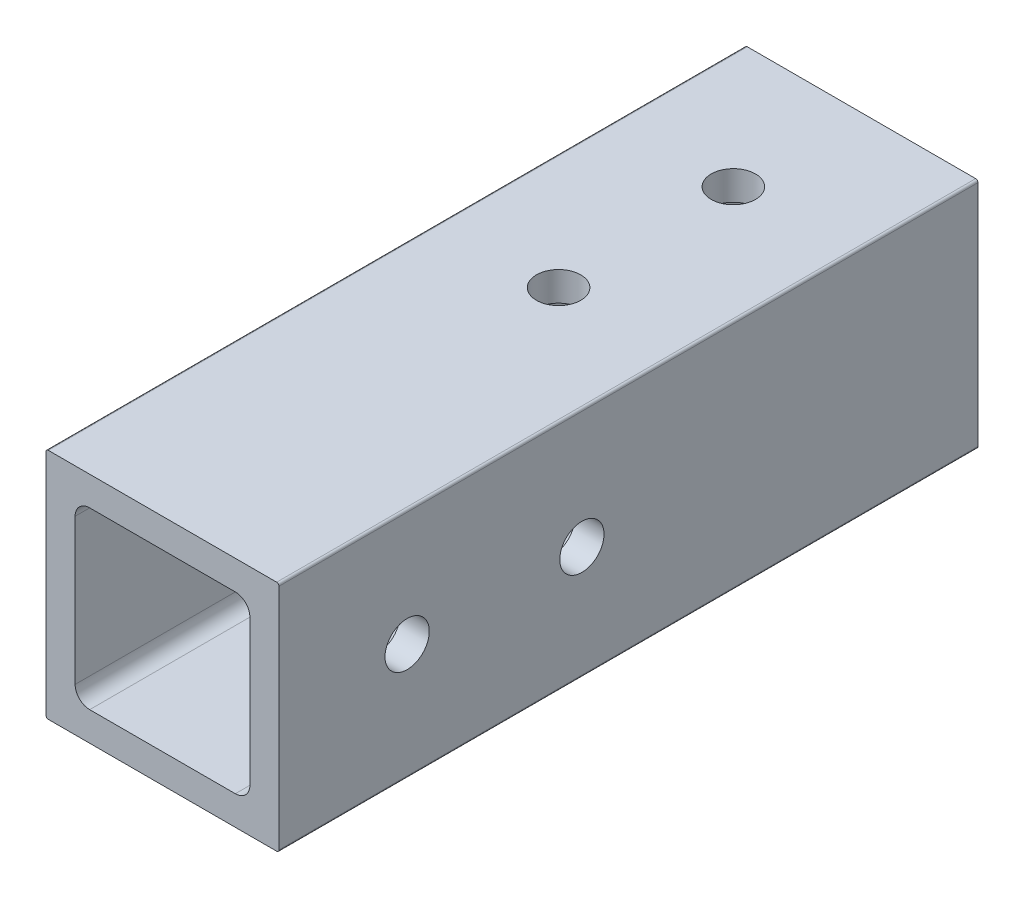
ISO-10303-21;
HEADER;
FILE_DESCRIPTION(('STEP AP214'),'2;1');
FILE_NAME('part.step','',(''),(''),'','','');
FILE_SCHEMA(('AUTOMOTIVE_DESIGN { 1 0 10303 214 1 1 1 1 }'));
ENDSEC;
DATA;
#1=APPLICATION_CONTEXT('core data for automotive mechanical design processes');
#2=APPLICATION_PROTOCOL_DEFINITION('international standard','automotive_design',2000,#1);
#3=PRODUCT_CONTEXT('',#1,'mechanical');
#4=PRODUCT('Part','Part','',(#3));
#5=PRODUCT_RELATED_PRODUCT_CATEGORY('part','',(#4));
#6=PRODUCT_DEFINITION_FORMATION('','',#4);
#7=PRODUCT_DEFINITION_CONTEXT('part definition',#1,'design');
#8=PRODUCT_DEFINITION('design','',#6,#7);
#9=PRODUCT_DEFINITION_SHAPE('','',#8);
#10=(LENGTH_UNIT() NAMED_UNIT(*) SI_UNIT(.MILLI.,.METRE.));
#11=(NAMED_UNIT(*) PLANE_ANGLE_UNIT() SI_UNIT($,.RADIAN.));
#12=(NAMED_UNIT(*) SI_UNIT($,.STERADIAN.) SOLID_ANGLE_UNIT());
#13=UNCERTAINTY_MEASURE_WITH_UNIT(LENGTH_MEASURE(1.E-05),#10,'distance_accuracy_value','');
#14=(GEOMETRIC_REPRESENTATION_CONTEXT(3) GLOBAL_UNCERTAINTY_ASSIGNED_CONTEXT((#13)) GLOBAL_UNIT_ASSIGNED_CONTEXT((#10,
#11,#12)) REPRESENTATION_CONTEXT('',''));
#15=CARTESIAN_POINT('',(0.,0.,0.));
#16=DIRECTION('',(0.,0.,1.));
#17=DIRECTION('',(1.,0.,0.));
#18=AXIS2_PLACEMENT_3D('',#15,#16,#17);
#19=CARTESIAN_POINT('',(3.175,4.7625,1828.8));
#20=DIRECTION('',(1.,0.,0.));
#21=DIRECTION('',(0.,1.,0.));
#22=AXIS2_PLACEMENT_3D('',#19,#20,#21);
#23=PLANE('',#22);
#24=CARTESIAN_POINT('',(3.175,12.3513725490173,1795.78));
#25=DIRECTION('',(1.,0.,0.));
#26=DIRECTION('',(0.,0.,-1.));
#27=AXIS2_PLACEMENT_3D('',#24,#25,#26);
#28=CIRCLE('',#27,2.41299999999989);
#29=CARTESIAN_POINT('',(3.175,12.3513725490173,1793.367));
#30=VERTEX_POINT('',#29);
#31=EDGE_CURVE('E296',#30,#30,#28,.T.);
#32=ORIENTED_EDGE('',*,*,#31,.F.);
#33=EDGE_LOOP('',(#32));
#34=FACE_BOUND('',#33,.T.);
#35=CARTESIAN_POINT('',(3.175,12.6999999999977,1814.83));
#36=DIRECTION('',(1.,0.,0.));
#37=DIRECTION('',(0.,0.,-1.));
#38=AXIS2_PLACEMENT_3D('',#35,#36,#37);
#39=CIRCLE('',#38,2.41299999999988);
#40=CARTESIAN_POINT('',(3.175,12.6999999999977,1812.417));
#41=VERTEX_POINT('',#40);
#42=EDGE_CURVE('E563',#41,#41,#39,.T.);
#43=ORIENTED_EDGE('',*,*,#42,.F.);
#44=EDGE_LOOP('',(#43));
#45=FACE_BOUND('',#44,.T.);
#46=DIRECTION('',(0.,-1.,0.));
#47=VECTOR('',#46,1.);
#48=CARTESIAN_POINT('',(3.175,4.7625,1752.6));
#49=LINE('',#48,#47);
#50=CARTESIAN_POINT('',(3.175,20.6375,1752.6));
#51=VERTEX_POINT('',#50);
#52=CARTESIAN_POINT('',(3.175,4.7625,1752.6));
#53=VERTEX_POINT('',#52);
#54=EDGE_CURVE('E59',#51,#53,#49,.T.);
#55=ORIENTED_EDGE('',*,*,#54,.F.);
#56=DIRECTION('',(0.,0.,-1.));
#57=VECTOR('',#56,1.);
#58=CARTESIAN_POINT('',(3.175,20.6375,1828.8));
#59=LINE('',#58,#57);
#60=CARTESIAN_POINT('',(3.175,20.6375,1828.8));
#61=VERTEX_POINT('',#60);
#62=EDGE_CURVE('E51',#61,#51,#59,.T.);
#63=ORIENTED_EDGE('',*,*,#62,.F.);
#64=DIRECTION('',(0.,-1.,0.));
#65=VECTOR('',#64,1.);
#66=CARTESIAN_POINT('',(3.175,4.7625,1828.8));
#67=LINE('',#66,#65);
#68=CARTESIAN_POINT('',(3.175,4.7625,1828.8));
#69=VERTEX_POINT('',#68);
#70=EDGE_CURVE('E218',#61,#69,#67,.T.);
#71=ORIENTED_EDGE('',*,*,#70,.T.);
#72=DIRECTION('',(0.,0.,-1.));
#73=VECTOR('',#72,1.);
#74=CARTESIAN_POINT('',(3.175,4.7625,1828.8));
#75=LINE('',#74,#73);
#76=EDGE_CURVE('E326',#69,#53,#75,.T.);
#77=ORIENTED_EDGE('',*,*,#76,.T.);
#78=EDGE_LOOP('',(#55,#63,#71,#77));
#79=FACE_BOUND('',#78,.T.);
#80=ADVANCED_FACE('F42',(#34,#45,#79),#23,.T.);
#81=CARTESIAN_POINT('',(4.7625,20.6375,1828.8));
#82=DIRECTION('',(0.,0.,-1.));
#83=DIRECTION('',(-1.,0.,0.));
#84=AXIS2_PLACEMENT_3D('',#81,#82,#83);
#85=CYLINDRICAL_SURFACE('',#84,1.5875);
#86=ORIENTED_EDGE('',*,*,#62,.T.);
#87=CARTESIAN_POINT('',(4.7625,20.6375,1752.6));
#88=DIRECTION('',(0.,0.,1.));
#89=DIRECTION('',(1.,0.,0.));
#90=AXIS2_PLACEMENT_3D('',#87,#88,#89);
#91=CIRCLE('',#90,1.5875);
#92=CARTESIAN_POINT('',(4.7625,22.225,1752.6));
#93=VERTEX_POINT('',#92);
#94=EDGE_CURVE('E322',#51,#93,#91,.F.);
#95=ORIENTED_EDGE('',*,*,#94,.T.);
#96=DIRECTION('',(0.,0.,-1.));
#97=VECTOR('',#96,1.);
#98=CARTESIAN_POINT('',(4.7625,22.225,1828.8));
#99=LINE('',#98,#97);
#100=CARTESIAN_POINT('',(4.7625,22.225,1828.8));
#101=VERTEX_POINT('',#100);
#102=EDGE_CURVE('E333',#101,#93,#99,.T.);
#103=ORIENTED_EDGE('',*,*,#102,.F.);
#104=CARTESIAN_POINT('',(4.7625,20.6375,1828.8));
#105=DIRECTION('',(0.,0.,1.));
#106=DIRECTION('',(-1.,0.,0.));
#107=AXIS2_PLACEMENT_3D('',#104,#105,#106);
#108=CIRCLE('',#107,1.5875);
#109=EDGE_CURVE('E223',#101,#61,#108,.T.);
#110=ORIENTED_EDGE('',*,*,#109,.T.);
#111=EDGE_LOOP('',(#86,#95,#103,#110));
#112=FACE_BOUND('',#111,.T.);
#113=ADVANCED_FACE('F382',(#112),#85,.F.);
#114=CARTESIAN_POINT('',(4.7625,22.225,1828.8));
#115=DIRECTION('',(0.,-1.,0.));
#116=DIRECTION('',(0.,0.,-1.));
#117=AXIS2_PLACEMENT_3D('',#114,#115,#116);
#118=PLANE('',#117);
#119=CARTESIAN_POINT('',(12.7,22.225,1766.57));
#120=DIRECTION('',(0.,-1.,0.));
#121=DIRECTION('',(0.,0.,-1.));
#122=AXIS2_PLACEMENT_3D('',#119,#120,#121);
#123=CIRCLE('',#122,2.41300000000001);
#124=CARTESIAN_POINT('',(12.7,22.225,1764.157));
#125=VERTEX_POINT('',#124);
#126=EDGE_CURVE('E286',#125,#125,#123,.F.);
#127=ORIENTED_EDGE('',*,*,#126,.T.);
#128=EDGE_LOOP('',(#127));
#129=FACE_BOUND('',#128,.T.);
#130=CARTESIAN_POINT('',(12.7,22.225,1785.62));
#131=DIRECTION('',(0.,-1.,0.));
#132=DIRECTION('',(0.,0.,-1.));
#133=AXIS2_PLACEMENT_3D('',#130,#131,#132);
#134=CIRCLE('',#133,2.41300000000001);
#135=CARTESIAN_POINT('',(12.7,22.225,1783.207));
#136=VERTEX_POINT('',#135);
#137=EDGE_CURVE('E291',#136,#136,#134,.F.);
#138=ORIENTED_EDGE('',*,*,#137,.T.);
#139=EDGE_LOOP('',(#138));
#140=FACE_BOUND('',#139,.T.);
#141=DIRECTION('',(-1.,0.,0.));
#142=VECTOR('',#141,1.);
#143=CARTESIAN_POINT('',(4.7625,22.225,1752.6));
#144=LINE('',#143,#142);
#145=CARTESIAN_POINT('',(20.6375,22.225,1752.6));
#146=VERTEX_POINT('',#145);
#147=EDGE_CURVE('E320',#146,#93,#144,.T.);
#148=ORIENTED_EDGE('',*,*,#147,.F.);
#149=DIRECTION('',(0.,0.,-1.));
#150=VECTOR('',#149,1.);
#151=CARTESIAN_POINT('',(20.6375,22.225,1828.8));
#152=LINE('',#151,#150);
#153=CARTESIAN_POINT('',(20.6375,22.225,1828.8));
#154=VERTEX_POINT('',#153);
#155=EDGE_CURVE('E238',#154,#146,#152,.T.);
#156=ORIENTED_EDGE('',*,*,#155,.F.);
#157=DIRECTION('',(-1.,0.,0.));
#158=VECTOR('',#157,1.);
#159=CARTESIAN_POINT('',(4.7625,22.225,1828.8));
#160=LINE('',#159,#158);
#161=EDGE_CURVE('E227',#154,#101,#160,.T.);
#162=ORIENTED_EDGE('',*,*,#161,.T.);
#163=ORIENTED_EDGE('',*,*,#102,.T.);
#164=EDGE_LOOP('',(#148,#156,#162,#163));
#165=FACE_BOUND('',#164,.T.);
#166=ADVANCED_FACE('F378',(#129,#140,#165),#118,.T.);
#167=CARTESIAN_POINT('',(20.6375,20.6375,1828.8));
#168=DIRECTION('',(0.,0.,-1.));
#169=DIRECTION('',(-1.,0.,0.));
#170=AXIS2_PLACEMENT_3D('',#167,#168,#169);
#171=CYLINDRICAL_SURFACE('',#170,1.5875);
#172=ORIENTED_EDGE('',*,*,#155,.T.);
#173=CARTESIAN_POINT('',(20.6375,20.6375,1752.6));
#174=DIRECTION('',(0.,0.,1.));
#175=DIRECTION('',(1.,0.,0.));
#176=AXIS2_PLACEMENT_3D('',#173,#174,#175);
#177=CIRCLE('',#176,1.5875);
#178=CARTESIAN_POINT('',(22.225,20.6375,1752.6));
#179=VERTEX_POINT('',#178);
#180=EDGE_CURVE('E317',#146,#179,#177,.F.);
#181=ORIENTED_EDGE('',*,*,#180,.T.);
#182=DIRECTION('',(0.,0.,-1.));
#183=VECTOR('',#182,1.);
#184=CARTESIAN_POINT('',(22.225,20.6375,1828.8));
#185=LINE('',#184,#183);
#186=CARTESIAN_POINT('',(22.225,20.6375,1828.8));
#187=VERTEX_POINT('',#186);
#188=EDGE_CURVE('E234',#187,#179,#185,.T.);
#189=ORIENTED_EDGE('',*,*,#188,.F.);
#190=CARTESIAN_POINT('',(20.6375,20.6375,1828.8));
#191=DIRECTION('',(0.,0.,1.));
#192=DIRECTION('',(-1.,0.,0.));
#193=AXIS2_PLACEMENT_3D('',#190,#191,#192);
#194=CIRCLE('',#193,1.5875);
#195=EDGE_CURVE('E213',#187,#154,#194,.T.);
#196=ORIENTED_EDGE('',*,*,#195,.T.);
#197=EDGE_LOOP('',(#172,#181,#189,#196));
#198=FACE_BOUND('',#197,.T.);
#199=ADVANCED_FACE('F374',(#198),#171,.F.);
#200=CARTESIAN_POINT('',(22.225,4.7625,1828.8));
#201=DIRECTION('',(-1.,0.,0.));
#202=DIRECTION('',(0.,0.,1.));
#203=AXIS2_PLACEMENT_3D('',#200,#201,#202);
#204=PLANE('',#203);
#205=CARTESIAN_POINT('',(22.225,12.3513725490173,1795.78));
#206=DIRECTION('',(-1.,0.,0.));
#207=DIRECTION('',(0.,0.,1.));
#208=AXIS2_PLACEMENT_3D('',#205,#206,#207);
#209=CIRCLE('',#208,2.41299999999989);
#210=CARTESIAN_POINT('',(22.225,12.3513725490173,1798.193));
#211=VERTEX_POINT('',#210);
#212=EDGE_CURVE('E562',#211,#211,#209,.T.);
#213=ORIENTED_EDGE('',*,*,#212,.F.);
#214=EDGE_LOOP('',(#213));
#215=FACE_BOUND('',#214,.T.);
#216=CARTESIAN_POINT('',(22.225,12.6999999999977,1814.83));
#217=DIRECTION('',(-1.,0.,0.));
#218=DIRECTION('',(0.,0.,1.));
#219=AXIS2_PLACEMENT_3D('',#216,#217,#218);
#220=CIRCLE('',#219,2.41299999999988);
#221=CARTESIAN_POINT('',(22.225,12.6999999999977,1817.243));
#222=VERTEX_POINT('',#221);
#223=EDGE_CURVE('E567',#222,#222,#220,.T.);
#224=ORIENTED_EDGE('',*,*,#223,.F.);
#225=EDGE_LOOP('',(#224));
#226=FACE_BOUND('',#225,.T.);
#227=DIRECTION('',(0.,1.,0.));
#228=VECTOR('',#227,1.);
#229=CARTESIAN_POINT('',(22.225,4.7625,1752.6));
#230=LINE('',#229,#228);
#231=CARTESIAN_POINT('',(22.225,4.7625,1752.6));
#232=VERTEX_POINT('',#231);
#233=EDGE_CURVE('E315',#232,#179,#230,.T.);
#234=ORIENTED_EDGE('',*,*,#233,.F.);
#235=DIRECTION('',(0.,0.,-1.));
#236=VECTOR('',#235,1.);
#237=CARTESIAN_POINT('',(22.225,4.7625,1828.8));
#238=LINE('',#237,#236);
#239=CARTESIAN_POINT('',(22.225,4.7625,1828.8));
#240=VERTEX_POINT('',#239);
#241=EDGE_CURVE('E239',#240,#232,#238,.T.);
#242=ORIENTED_EDGE('',*,*,#241,.F.);
#243=DIRECTION('',(0.,1.,0.));
#244=VECTOR('',#243,1.);
#245=CARTESIAN_POINT('',(22.225,4.7625,1828.8));
#246=LINE('',#245,#244);
#247=EDGE_CURVE('E209',#240,#187,#246,.T.);
#248=ORIENTED_EDGE('',*,*,#247,.T.);
#249=ORIENTED_EDGE('',*,*,#188,.T.);
#250=EDGE_LOOP('',(#234,#242,#248,#249));
#251=FACE_BOUND('',#250,.T.);
#252=ADVANCED_FACE('F372',(#215,#226,#251),#204,.T.);
#253=CARTESIAN_POINT('',(20.6375,4.7625,1828.8));
#254=DIRECTION('',(0.,0.,-1.));
#255=DIRECTION('',(-1.,0.,0.));
#256=AXIS2_PLACEMENT_3D('',#253,#254,#255);
#257=CYLINDRICAL_SURFACE('',#256,1.5875);
#258=ORIENTED_EDGE('',*,*,#241,.T.);
#259=CARTESIAN_POINT('',(20.6375,4.7625,1752.6));
#260=DIRECTION('',(0.,0.,1.));
#261=DIRECTION('',(1.,0.,0.));
#262=AXIS2_PLACEMENT_3D('',#259,#260,#261);
#263=CIRCLE('',#262,1.5875);
#264=CARTESIAN_POINT('',(20.6375,3.175,1752.6));
#265=VERTEX_POINT('',#264);
#266=EDGE_CURVE('E312',#232,#265,#263,.F.);
#267=ORIENTED_EDGE('',*,*,#266,.T.);
#268=DIRECTION('',(0.,0.,-1.));
#269=VECTOR('',#268,1.);
#270=CARTESIAN_POINT('',(20.6375,3.175,1828.8));
#271=LINE('',#270,#269);
#272=CARTESIAN_POINT('',(20.6375,3.175,1828.8));
#273=VERTEX_POINT('',#272);
#274=EDGE_CURVE('E265',#273,#265,#271,.T.);
#275=ORIENTED_EDGE('',*,*,#274,.F.);
#276=CARTESIAN_POINT('',(20.6375,4.7625,1828.8));
#277=DIRECTION('',(0.,0.,1.));
#278=DIRECTION('',(-1.,0.,0.));
#279=AXIS2_PLACEMENT_3D('',#276,#277,#278);
#280=CIRCLE('',#279,1.5875);
#281=EDGE_CURVE('E212',#273,#240,#280,.T.);
#282=ORIENTED_EDGE('',*,*,#281,.T.);
#283=EDGE_LOOP('',(#258,#267,#275,#282));
#284=FACE_BOUND('',#283,.T.);
#285=ADVANCED_FACE('F369',(#284),#257,.F.);
#286=CARTESIAN_POINT('',(4.7625,3.175,1828.8));
#287=DIRECTION('',(0.,1.,0.));
#288=DIRECTION('',(1.,0.,0.));
#289=AXIS2_PLACEMENT_3D('',#286,#287,#288);
#290=PLANE('',#289);
#291=DIRECTION('',(1.,0.,0.));
#292=VECTOR('',#291,1.);
#293=CARTESIAN_POINT('',(4.7625,3.175,1752.6));
#294=LINE('',#293,#292);
#295=CARTESIAN_POINT('',(4.7625,3.175,1752.6));
#296=VERTEX_POINT('',#295);
#297=EDGE_CURVE('E310',#296,#265,#294,.T.);
#298=ORIENTED_EDGE('',*,*,#297,.F.);
#299=DIRECTION('',(0.,0.,-1.));
#300=VECTOR('',#299,1.);
#301=CARTESIAN_POINT('',(4.7625,3.175,1828.8));
#302=LINE('',#301,#300);
#303=CARTESIAN_POINT('',(4.7625,3.175,1828.8));
#304=VERTEX_POINT('',#303);
#305=EDGE_CURVE('E269',#304,#296,#302,.T.);
#306=ORIENTED_EDGE('',*,*,#305,.F.);
#307=DIRECTION('',(1.,0.,0.));
#308=VECTOR('',#307,1.);
#309=CARTESIAN_POINT('',(4.7625,3.175,1828.8));
#310=LINE('',#309,#308);
#311=EDGE_CURVE('E255',#304,#273,#310,.T.);
#312=ORIENTED_EDGE('',*,*,#311,.T.);
#313=ORIENTED_EDGE('',*,*,#274,.T.);
#314=EDGE_LOOP('',(#298,#306,#312,#313));
#315=FACE_BOUND('',#314,.T.);
#316=ADVANCED_FACE('F360',(#315),#290,.T.);
#317=CARTESIAN_POINT('',(4.7625,4.7625,1828.8));
#318=DIRECTION('',(0.,0.,-1.));
#319=DIRECTION('',(-1.,0.,0.));
#320=AXIS2_PLACEMENT_3D('',#317,#318,#319);
#321=CYLINDRICAL_SURFACE('',#320,1.5875);
#322=ORIENTED_EDGE('',*,*,#305,.T.);
#323=CARTESIAN_POINT('',(4.7625,4.7625,1752.6));
#324=DIRECTION('',(0.,0.,1.));
#325=DIRECTION('',(1.,0.,0.));
#326=AXIS2_PLACEMENT_3D('',#323,#324,#325);
#327=CIRCLE('',#326,1.5875);
#328=EDGE_CURVE('E308',#296,#53,#327,.F.);
#329=ORIENTED_EDGE('',*,*,#328,.T.);
#330=ORIENTED_EDGE('',*,*,#76,.F.);
#331=CARTESIAN_POINT('',(4.7625,4.7625,1828.8));
#332=DIRECTION('',(0.,0.,1.));
#333=DIRECTION('',(1.,0.,0.));
#334=AXIS2_PLACEMENT_3D('',#331,#332,#333);
#335=CIRCLE('',#334,1.5875);
#336=EDGE_CURVE('E214',#69,#304,#335,.T.);
#337=ORIENTED_EDGE('',*,*,#336,.T.);
#338=EDGE_LOOP('',(#322,#329,#330,#337));
#339=FACE_BOUND('',#338,.T.);
#340=ADVANCED_FACE('F355',(#339),#321,.F.);
#341=CARTESIAN_POINT('',(0.,0.254,1828.8));
#342=DIRECTION('',(1.,0.,0.));
#343=DIRECTION('',(0.,1.,0.));
#344=AXIS2_PLACEMENT_3D('',#341,#342,#343);
#345=PLANE('',#344);
#346=CARTESIAN_POINT('',(0.,12.3513725490173,1795.78));
#347=DIRECTION('',(1.,0.,0.));
#348=DIRECTION('',(0.,0.,-1.));
#349=AXIS2_PLACEMENT_3D('',#346,#347,#348);
#350=CIRCLE('',#349,2.41299999999989);
#351=CARTESIAN_POINT('',(0.,12.3513725490173,1793.367));
#352=VERTEX_POINT('',#351);
#353=EDGE_CURVE('E561',#352,#352,#350,.T.);
#354=ORIENTED_EDGE('',*,*,#353,.T.);
#355=EDGE_LOOP('',(#354));
#356=FACE_BOUND('',#355,.T.);
#357=CARTESIAN_POINT('',(0.,12.6999999999977,1814.83));
#358=DIRECTION('',(1.,0.,0.));
#359=DIRECTION('',(0.,0.,-1.));
#360=AXIS2_PLACEMENT_3D('',#357,#358,#359);
#361=CIRCLE('',#360,2.41299999999988);
#362=CARTESIAN_POINT('',(0.,12.6999999999977,1812.417));
#363=VERTEX_POINT('',#362);
#364=EDGE_CURVE('E572',#363,#363,#361,.T.);
#365=ORIENTED_EDGE('',*,*,#364,.T.);
#366=EDGE_LOOP('',(#365));
#367=FACE_BOUND('',#366,.T.);
#368=DIRECTION('',(0.,0.,-1.));
#369=VECTOR('',#368,1.);
#370=CARTESIAN_POINT('',(0.,25.146,1828.8));
#371=LINE('',#370,#369);
#372=CARTESIAN_POINT('',(0.,25.146,1828.8));
#373=VERTEX_POINT('',#372);
#374=CARTESIAN_POINT('',(0.,25.146,1752.6));
#375=VERTEX_POINT('',#374);
#376=EDGE_CURVE('E264',#373,#375,#371,.T.);
#377=ORIENTED_EDGE('',*,*,#376,.T.);
#378=DIRECTION('',(0.,-1.,0.));
#379=VECTOR('',#378,1.);
#380=CARTESIAN_POINT('',(0.,0.254,1752.6));
#381=LINE('',#380,#379);
#382=CARTESIAN_POINT('',(0.,0.254,1752.6));
#383=VERTEX_POINT('',#382);
#384=EDGE_CURVE('E186',#375,#383,#381,.T.);
#385=ORIENTED_EDGE('',*,*,#384,.T.);
#386=DIRECTION('',(0.,0.,-1.));
#387=VECTOR('',#386,1.);
#388=CARTESIAN_POINT('',(0.,0.254,1828.8));
#389=LINE('',#388,#387);
#390=CARTESIAN_POINT('',(0.,0.254,1828.8));
#391=VERTEX_POINT('',#390);
#392=EDGE_CURVE('E195',#391,#383,#389,.T.);
#393=ORIENTED_EDGE('',*,*,#392,.F.);
#394=DIRECTION('',(0.,-1.,0.));
#395=VECTOR('',#394,1.);
#396=CARTESIAN_POINT('',(0.,0.254,1828.8));
#397=LINE('',#396,#395);
#398=EDGE_CURVE('E219',#373,#391,#397,.T.);
#399=ORIENTED_EDGE('',*,*,#398,.F.);
#400=EDGE_LOOP('',(#377,#385,#393,#399));
#401=FACE_BOUND('',#400,.T.);
#402=ADVANCED_FACE('F415',(#356,#367,#401),#345,.F.);
#403=CARTESIAN_POINT('',(0.254,25.146,1828.8));
#404=DIRECTION('',(0.,0.,-1.));
#405=DIRECTION('',(-1.,0.,0.));
#406=AXIS2_PLACEMENT_3D('',#403,#404,#405);
#407=CYLINDRICAL_SURFACE('',#406,0.254);
#408=CARTESIAN_POINT('',(0.254,25.146,1752.6));
#409=DIRECTION('',(0.,0.,1.));
#410=DIRECTION('',(1.,0.,0.));
#411=AXIS2_PLACEMENT_3D('',#408,#409,#410);
#412=CIRCLE('',#411,0.254);
#413=CARTESIAN_POINT('',(0.254000000000004,25.4,1752.6));
#414=VERTEX_POINT('',#413);
#415=EDGE_CURVE('E177',#375,#414,#412,.F.);
#416=ORIENTED_EDGE('',*,*,#415,.F.);
#417=ORIENTED_EDGE('',*,*,#376,.F.);
#418=CARTESIAN_POINT('',(0.254,25.146,1828.8));
#419=DIRECTION('',(0.,0.,1.));
#420=DIRECTION('',(-1.,0.,0.));
#421=AXIS2_PLACEMENT_3D('',#418,#419,#420);
#422=CIRCLE('',#421,0.254);
#423=CARTESIAN_POINT('',(0.254,25.4,1828.8));
#424=VERTEX_POINT('',#423);
#425=EDGE_CURVE('E240',#424,#373,#422,.T.);
#426=ORIENTED_EDGE('',*,*,#425,.F.);
#427=DIRECTION('',(0.,0.,-1.));
#428=VECTOR('',#427,1.);
#429=CARTESIAN_POINT('',(0.254,25.4,1828.8));
#430=LINE('',#429,#428);
#431=EDGE_CURVE('E260',#424,#414,#430,.T.);
#432=ORIENTED_EDGE('',*,*,#431,.T.);
#433=EDGE_LOOP('',(#416,#417,#426,#432));
#434=FACE_BOUND('',#433,.T.);
#435=ADVANCED_FACE('F411',(#434),#407,.T.);
#436=CARTESIAN_POINT('',(0.254,25.4,1828.8));
#437=DIRECTION('',(0.,-1.,0.));
#438=DIRECTION('',(0.,0.,-1.));
#439=AXIS2_PLACEMENT_3D('',#436,#437,#438);
#440=PLANE('',#439);
#441=CARTESIAN_POINT('',(12.7,25.4,1766.57));
#442=DIRECTION('',(0.,-1.,0.));
#443=DIRECTION('',(0.,0.,-1.));
#444=AXIS2_PLACEMENT_3D('',#441,#442,#443);
#445=CIRCLE('',#444,2.41300000000001);
#446=CARTESIAN_POINT('',(12.7,25.4,1764.157));
#447=VERTEX_POINT('',#446);
#448=EDGE_CURVE('E46',#447,#447,#445,.F.);
#449=ORIENTED_EDGE('',*,*,#448,.F.);
#450=EDGE_LOOP('',(#449));
#451=FACE_BOUND('',#450,.T.);
#452=CARTESIAN_POINT('',(12.7,25.4,1785.62));
#453=DIRECTION('',(0.,-1.,0.));
#454=DIRECTION('',(0.,0.,-1.));
#455=AXIS2_PLACEMENT_3D('',#452,#453,#454);
#456=CIRCLE('',#455,2.41300000000001);
#457=CARTESIAN_POINT('',(12.7,25.4,1783.207));
#458=VERTEX_POINT('',#457);
#459=EDGE_CURVE('E284',#458,#458,#456,.F.);
#460=ORIENTED_EDGE('',*,*,#459,.F.);
#461=EDGE_LOOP('',(#460));
#462=FACE_BOUND('',#461,.T.);
#463=DIRECTION('',(0.,0.,-1.));
#464=VECTOR('',#463,1.);
#465=CARTESIAN_POINT('',(25.146,25.4,1828.8));
#466=LINE('',#465,#464);
#467=CARTESIAN_POINT('',(25.146,25.4,1828.8));
#468=VERTEX_POINT('',#467);
#469=CARTESIAN_POINT('',(25.146,25.4,1752.6));
#470=VERTEX_POINT('',#469);
#471=EDGE_CURVE('E256',#468,#470,#466,.T.);
#472=ORIENTED_EDGE('',*,*,#471,.T.);
#473=DIRECTION('',(1.,0.,0.));
#474=VECTOR('',#473,1.);
#475=CARTESIAN_POINT('',(-135.222379220066,25.4,1752.6));
#476=LINE('',#475,#474);
#477=EDGE_CURVE('E187',#414,#470,#476,.T.);
#478=ORIENTED_EDGE('',*,*,#477,.F.);
#479=ORIENTED_EDGE('',*,*,#431,.F.);
#480=DIRECTION('',(-1.,0.,0.));
#481=VECTOR('',#480,1.);
#482=CARTESIAN_POINT('',(0.254,25.4,1828.8));
#483=LINE('',#482,#481);
#484=EDGE_CURVE('E232',#468,#424,#483,.T.);
#485=ORIENTED_EDGE('',*,*,#484,.F.);
#486=EDGE_LOOP('',(#472,#478,#479,#485));
#487=FACE_BOUND('',#486,.T.);
#488=ADVANCED_FACE('F414',(#451,#462,#487),#440,.F.);
#489=CARTESIAN_POINT('',(25.146,25.146,1828.8));
#490=DIRECTION('',(0.,0.,-1.));
#491=DIRECTION('',(-1.,0.,0.));
#492=AXIS2_PLACEMENT_3D('',#489,#490,#491);
#493=CYLINDRICAL_SURFACE('',#492,0.254);
#494=CARTESIAN_POINT('',(25.146,25.146,1752.6));
#495=DIRECTION('',(0.,0.,1.));
#496=DIRECTION('',(1.,0.,0.));
#497=AXIS2_PLACEMENT_3D('',#494,#495,#496);
#498=CIRCLE('',#497,0.254);
#499=CARTESIAN_POINT('',(25.4,25.146,1752.6));
#500=VERTEX_POINT('',#499);
#501=EDGE_CURVE('E306',#470,#500,#498,.F.);
#502=ORIENTED_EDGE('',*,*,#501,.F.);
#503=ORIENTED_EDGE('',*,*,#471,.F.);
#504=CARTESIAN_POINT('',(25.146,25.146,1828.8));
#505=DIRECTION('',(0.,0.,1.));
#506=DIRECTION('',(-1.,0.,0.));
#507=AXIS2_PLACEMENT_3D('',#504,#505,#506);
#508=CIRCLE('',#507,0.254);
#509=CARTESIAN_POINT('',(25.4,25.146,1828.8));
#510=VERTEX_POINT('',#509);
#511=EDGE_CURVE('E228',#510,#468,#508,.T.);
#512=ORIENTED_EDGE('',*,*,#511,.F.);
#513=DIRECTION('',(0.,0.,-1.));
#514=VECTOR('',#513,1.);
#515=CARTESIAN_POINT('',(25.4,25.146,1828.8));
#516=LINE('',#515,#514);
#517=EDGE_CURVE('E201',#510,#500,#516,.T.);
#518=ORIENTED_EDGE('',*,*,#517,.T.);
#519=EDGE_LOOP('',(#502,#503,#512,#518));
#520=FACE_BOUND('',#519,.T.);
#521=ADVANCED_FACE('F44',(#520),#493,.T.);
#522=CARTESIAN_POINT('',(25.4,0.254,1828.8));
#523=DIRECTION('',(-1.,0.,0.));
#524=DIRECTION('',(0.,0.,1.));
#525=AXIS2_PLACEMENT_3D('',#522,#523,#524);
#526=PLANE('',#525);
#527=CARTESIAN_POINT('',(25.4,12.3513725490173,1795.78));
#528=DIRECTION('',(-1.,0.,0.));
#529=DIRECTION('',(0.,0.,1.));
#530=AXIS2_PLACEMENT_3D('',#527,#528,#529);
#531=CIRCLE('',#530,2.41299999999989);
#532=CARTESIAN_POINT('',(25.4,12.3513725490173,1798.193));
#533=VERTEX_POINT('',#532);
#534=EDGE_CURVE('E575',#533,#533,#531,.T.);
#535=ORIENTED_EDGE('',*,*,#534,.T.);
#536=EDGE_LOOP('',(#535));
#537=FACE_BOUND('',#536,.T.);
#538=CARTESIAN_POINT('',(25.4,12.6999999999977,1814.83));
#539=DIRECTION('',(-1.,0.,0.));
#540=DIRECTION('',(0.,0.,1.));
#541=AXIS2_PLACEMENT_3D('',#538,#539,#540);
#542=CIRCLE('',#541,2.41299999999988);
#543=CARTESIAN_POINT('',(25.4,12.6999999999977,1817.243));
#544=VERTEX_POINT('',#543);
#545=EDGE_CURVE('E576',#544,#544,#542,.T.);
#546=ORIENTED_EDGE('',*,*,#545,.T.);
#547=EDGE_LOOP('',(#546));
#548=FACE_BOUND('',#547,.T.);
#549=DIRECTION('',(0.,0.,-1.));
#550=VECTOR('',#549,1.);
#551=CARTESIAN_POINT('',(25.4,0.254,1828.8));
#552=LINE('',#551,#550);
#553=CARTESIAN_POINT('',(25.4,0.254,1828.8));
#554=VERTEX_POINT('',#553);
#555=CARTESIAN_POINT('',(25.4,0.254,1752.6));
#556=VERTEX_POINT('',#555);
#557=EDGE_CURVE('E194',#554,#556,#552,.T.);
#558=ORIENTED_EDGE('',*,*,#557,.T.);
#559=DIRECTION('',(0.,1.,0.));
#560=VECTOR('',#559,1.);
#561=CARTESIAN_POINT('',(25.4,0.254,1752.6));
#562=LINE('',#561,#560);
#563=EDGE_CURVE('E173',#556,#500,#562,.T.);
#564=ORIENTED_EDGE('',*,*,#563,.T.);
#565=ORIENTED_EDGE('',*,*,#517,.F.);
#566=DIRECTION('',(0.,1.,0.));
#567=VECTOR('',#566,1.);
#568=CARTESIAN_POINT('',(25.4,0.254,1828.8));
#569=LINE('',#568,#567);
#570=EDGE_CURVE('E233',#554,#510,#569,.T.);
#571=ORIENTED_EDGE('',*,*,#570,.F.);
#572=EDGE_LOOP('',(#558,#564,#565,#571));
#573=FACE_BOUND('',#572,.T.);
#574=ADVANCED_FACE('F405',(#537,#548,#573),#526,.F.);
#575=CARTESIAN_POINT('',(25.146,0.254,1828.8));
#576=DIRECTION('',(0.,0.,-1.));
#577=DIRECTION('',(-1.,0.,0.));
#578=AXIS2_PLACEMENT_3D('',#575,#576,#577);
#579=CYLINDRICAL_SURFACE('',#578,0.254);
#580=CARTESIAN_POINT('',(25.146,0.254,1752.6));
#581=DIRECTION('',(0.,0.,1.));
#582=DIRECTION('',(1.,0.,0.));
#583=AXIS2_PLACEMENT_3D('',#580,#581,#582);
#584=CIRCLE('',#583,0.254);
#585=CARTESIAN_POINT('',(25.146,0.,1752.6));
#586=VERTEX_POINT('',#585);
#587=EDGE_CURVE('E170',#556,#586,#584,.F.);
#588=ORIENTED_EDGE('',*,*,#587,.F.);
#589=ORIENTED_EDGE('',*,*,#557,.F.);
#590=CARTESIAN_POINT('',(25.146,0.254,1828.8));
#591=DIRECTION('',(0.,0.,1.));
#592=DIRECTION('',(1.,0.,0.));
#593=AXIS2_PLACEMENT_3D('',#590,#591,#592);
#594=CIRCLE('',#593,0.254);
#595=CARTESIAN_POINT('',(25.146,0.,1828.8));
#596=VERTEX_POINT('',#595);
#597=EDGE_CURVE('E191',#596,#554,#594,.T.);
#598=ORIENTED_EDGE('',*,*,#597,.F.);
#599=DIRECTION('',(0.,0.,-1.));
#600=VECTOR('',#599,1.);
#601=CARTESIAN_POINT('',(25.146,0.,1828.8));
#602=LINE('',#601,#600);
#603=EDGE_CURVE('E183',#596,#586,#602,.T.);
#604=ORIENTED_EDGE('',*,*,#603,.T.);
#605=EDGE_LOOP('',(#588,#589,#598,#604));
#606=FACE_BOUND('',#605,.T.);
#607=ADVANCED_FACE('F189',(#606),#579,.T.);
#608=CARTESIAN_POINT('',(0.254,0.,1828.8));
#609=DIRECTION('',(0.,1.,0.));
#610=DIRECTION('',(1.,0.,0.));
#611=AXIS2_PLACEMENT_3D('',#608,#609,#610);
#612=PLANE('',#611);
#613=DIRECTION('',(0.,0.,-1.));
#614=VECTOR('',#613,1.);
#615=CARTESIAN_POINT('',(0.254,0.,1828.8));
#616=LINE('',#615,#614);
#617=CARTESIAN_POINT('',(0.254,0.,1828.8));
#618=VERTEX_POINT('',#617);
#619=CARTESIAN_POINT('',(0.254,0.,1752.6));
#620=VERTEX_POINT('',#619);
#621=EDGE_CURVE('E185',#618,#620,#616,.T.);
#622=ORIENTED_EDGE('',*,*,#621,.T.);
#623=DIRECTION('',(-1.,0.,0.));
#624=VECTOR('',#623,1.);
#625=CARTESIAN_POINT('',(-135.222379220066,0.,1752.6));
#626=LINE('',#625,#624);
#627=EDGE_CURVE('E66',#586,#620,#626,.T.);
#628=ORIENTED_EDGE('',*,*,#627,.F.);
#629=ORIENTED_EDGE('',*,*,#603,.F.);
#630=DIRECTION('',(1.,0.,0.));
#631=VECTOR('',#630,1.);
#632=CARTESIAN_POINT('',(0.254,0.,1828.8));
#633=LINE('',#632,#631);
#634=EDGE_CURVE('E249',#618,#596,#633,.T.);
#635=ORIENTED_EDGE('',*,*,#634,.F.);
#636=EDGE_LOOP('',(#622,#628,#629,#635));
#637=FACE_BOUND('',#636,.T.);
#638=ADVANCED_FACE('F181',(#637),#612,.F.);
#639=CARTESIAN_POINT('',(0.254,0.254,1828.8));
#640=DIRECTION('',(0.,0.,-1.));
#641=DIRECTION('',(-1.,0.,0.));
#642=AXIS2_PLACEMENT_3D('',#639,#640,#641);
#643=CYLINDRICAL_SURFACE('',#642,0.254);
#644=CARTESIAN_POINT('',(0.254,0.254,1752.6));
#645=DIRECTION('',(0.,0.,1.));
#646=DIRECTION('',(1.,0.,0.));
#647=AXIS2_PLACEMENT_3D('',#644,#645,#646);
#648=CIRCLE('',#647,0.254);
#649=EDGE_CURVE('E11',#620,#383,#648,.F.);
#650=ORIENTED_EDGE('',*,*,#649,.F.);
#651=ORIENTED_EDGE('',*,*,#621,.F.);
#652=CARTESIAN_POINT('',(0.254,0.254,1828.8));
#653=DIRECTION('',(0.,0.,1.));
#654=DIRECTION('',(-1.,0.,0.));
#655=AXIS2_PLACEMENT_3D('',#652,#653,#654);
#656=CIRCLE('',#655,0.254);
#657=EDGE_CURVE('E252',#391,#618,#656,.T.);
#658=ORIENTED_EDGE('',*,*,#657,.F.);
#659=ORIENTED_EDGE('',*,*,#392,.T.);
#660=EDGE_LOOP('',(#650,#651,#658,#659));
#661=FACE_BOUND('',#660,.T.);
#662=ADVANCED_FACE('F397',(#661),#643,.T.);
#663=CARTESIAN_POINT('',(0.254,0.254,1828.8));
#664=DIRECTION('',(0.,0.,-1.));
#665=DIRECTION('',(0.,-1.,0.));
#666=AXIS2_PLACEMENT_3D('',#663,#664,#665);
#667=PLANE('',#666);
#668=ORIENTED_EDGE('',*,*,#336,.F.);
#669=ORIENTED_EDGE('',*,*,#70,.F.);
#670=ORIENTED_EDGE('',*,*,#109,.F.);
#671=ORIENTED_EDGE('',*,*,#161,.F.);
#672=ORIENTED_EDGE('',*,*,#195,.F.);
#673=ORIENTED_EDGE('',*,*,#247,.F.);
#674=ORIENTED_EDGE('',*,*,#281,.F.);
#675=ORIENTED_EDGE('',*,*,#311,.F.);
#676=EDGE_LOOP('',(#668,#669,#670,#671,#672,#673,#674,#675));
#677=FACE_BOUND('',#676,.T.);
#678=ORIENTED_EDGE('',*,*,#657,.T.);
#679=ORIENTED_EDGE('',*,*,#634,.T.);
#680=ORIENTED_EDGE('',*,*,#597,.T.);
#681=ORIENTED_EDGE('',*,*,#570,.T.);
#682=ORIENTED_EDGE('',*,*,#511,.T.);
#683=ORIENTED_EDGE('',*,*,#484,.T.);
#684=ORIENTED_EDGE('',*,*,#425,.T.);
#685=ORIENTED_EDGE('',*,*,#398,.T.);
#686=EDGE_LOOP('',(#678,#679,#680,#681,#682,#683,#684,#685));
#687=FACE_BOUND('',#686,.T.);
#688=ADVANCED_FACE('F363',(#677,#687),#667,.F.);
#689=CARTESIAN_POINT('',(-135.222379220066,-1773.32765223686,1752.6));
#690=DIRECTION('',(0.,0.,1.));
#691=DIRECTION('',(1.,0.,0.));
#692=AXIS2_PLACEMENT_3D('',#689,#690,#691);
#693=PLANE('',#692);
#694=ORIENTED_EDGE('',*,*,#54,.T.);
#695=ORIENTED_EDGE('',*,*,#328,.F.);
#696=ORIENTED_EDGE('',*,*,#297,.T.);
#697=ORIENTED_EDGE('',*,*,#266,.F.);
#698=ORIENTED_EDGE('',*,*,#233,.T.);
#699=ORIENTED_EDGE('',*,*,#180,.F.);
#700=ORIENTED_EDGE('',*,*,#147,.T.);
#701=ORIENTED_EDGE('',*,*,#94,.F.);
#702=EDGE_LOOP('',(#694,#695,#696,#697,#698,#699,#700,#701));
#703=FACE_BOUND('',#702,.T.);
#704=ORIENTED_EDGE('',*,*,#501,.T.);
#705=ORIENTED_EDGE('',*,*,#563,.F.);
#706=ORIENTED_EDGE('',*,*,#587,.T.);
#707=ORIENTED_EDGE('',*,*,#627,.T.);
#708=ORIENTED_EDGE('',*,*,#649,.T.);
#709=ORIENTED_EDGE('',*,*,#384,.F.);
#710=ORIENTED_EDGE('',*,*,#415,.T.);
#711=ORIENTED_EDGE('',*,*,#477,.T.);
#712=EDGE_LOOP('',(#704,#705,#706,#707,#708,#709,#710,#711));
#713=FACE_BOUND('',#712,.T.);
#714=ADVANCED_FACE('F171',(#703,#713),#693,.F.);
#715=CARTESIAN_POINT('',(12.7,25.400012,1785.62));
#716=DIRECTION('',(0.,-1.,0.));
#717=DIRECTION('',(0.,0.,-1.));
#718=AXIS2_PLACEMENT_3D('',#715,#716,#717);
#719=CYLINDRICAL_SURFACE('',#718,2.41300000000001);
#720=ORIENTED_EDGE('',*,*,#137,.F.);
#721=EDGE_LOOP('',(#720));
#722=FACE_BOUND('',#721,.T.);
#723=ORIENTED_EDGE('',*,*,#459,.T.);
#724=EDGE_LOOP('',(#723));
#725=FACE_BOUND('',#724,.T.);
#726=ADVANCED_FACE('F435',(#722,#725),#719,.F.);
#727=CARTESIAN_POINT('',(12.7,25.400012,1766.57));
#728=DIRECTION('',(0.,-1.,0.));
#729=DIRECTION('',(0.,0.,-1.));
#730=AXIS2_PLACEMENT_3D('',#727,#728,#729);
#731=CYLINDRICAL_SURFACE('',#730,2.41300000000001);
#732=ORIENTED_EDGE('',*,*,#126,.F.);
#733=EDGE_LOOP('',(#732));
#734=FACE_BOUND('',#733,.T.);
#735=ORIENTED_EDGE('',*,*,#448,.T.);
#736=EDGE_LOOP('',(#735));
#737=FACE_BOUND('',#736,.T.);
#738=ADVANCED_FACE('F437',(#734,#737),#731,.F.);
#739=CARTESIAN_POINT('',(25.4,12.6999999999977,1814.83));
#740=DIRECTION('',(-1.,0.,0.));
#741=DIRECTION('',(0.,0.,1.));
#742=AXIS2_PLACEMENT_3D('',#739,#740,#741);
#743=CYLINDRICAL_SURFACE('',#742,2.41299999999988);
#744=ORIENTED_EDGE('',*,*,#223,.T.);
#745=EDGE_LOOP('',(#744));
#746=FACE_BOUND('',#745,.T.);
#747=ORIENTED_EDGE('',*,*,#545,.F.);
#748=EDGE_LOOP('',(#747));
#749=FACE_BOUND('',#748,.T.);
#750=ADVANCED_FACE('F443',(#746,#749),#743,.F.);
#751=CARTESIAN_POINT('',(25.4,12.3513725490173,1795.78));
#752=DIRECTION('',(-1.,0.,0.));
#753=DIRECTION('',(0.,0.,1.));
#754=AXIS2_PLACEMENT_3D('',#751,#752,#753);
#755=CYLINDRICAL_SURFACE('',#754,2.41299999999989);
#756=ORIENTED_EDGE('',*,*,#212,.T.);
#757=EDGE_LOOP('',(#756));
#758=FACE_BOUND('',#757,.T.);
#759=ORIENTED_EDGE('',*,*,#534,.F.);
#760=EDGE_LOOP('',(#759));
#761=FACE_BOUND('',#760,.T.);
#762=ADVANCED_FACE('F526',(#758,#761),#755,.F.);
#763=ORIENTED_EDGE('',*,*,#42,.T.);
#764=EDGE_LOOP('',(#763));
#765=FACE_BOUND('',#764,.T.);
#766=ORIENTED_EDGE('',*,*,#364,.F.);
#767=EDGE_LOOP('',(#766));
#768=FACE_BOUND('',#767,.T.);
#769=ADVANCED_FACE('F528',(#765,#768),#743,.F.);
#770=ORIENTED_EDGE('',*,*,#31,.T.);
#771=EDGE_LOOP('',(#770));
#772=FACE_BOUND('',#771,.T.);
#773=ORIENTED_EDGE('',*,*,#353,.F.);
#774=EDGE_LOOP('',(#773));
#775=FACE_BOUND('',#774,.T.);
#776=ADVANCED_FACE('F538',(#772,#775),#755,.F.);
#777=CLOSED_SHELL('',(#80,#113,#166,#199,#252,#285,#316,#340,#402,#435,#488,#521,#574,#607,#638,
#662,#688,#714,#726,#738,#750,#762,#769,#776));
#778=MANIFOLD_SOLID_BREP('B2',#777);
#779=ADVANCED_BREP_SHAPE_REPRESENTATION('',(#18,#778),#14);
#780=SHAPE_DEFINITION_REPRESENTATION(#9,#779);
ENDSEC;
END-ISO-10303-21;
